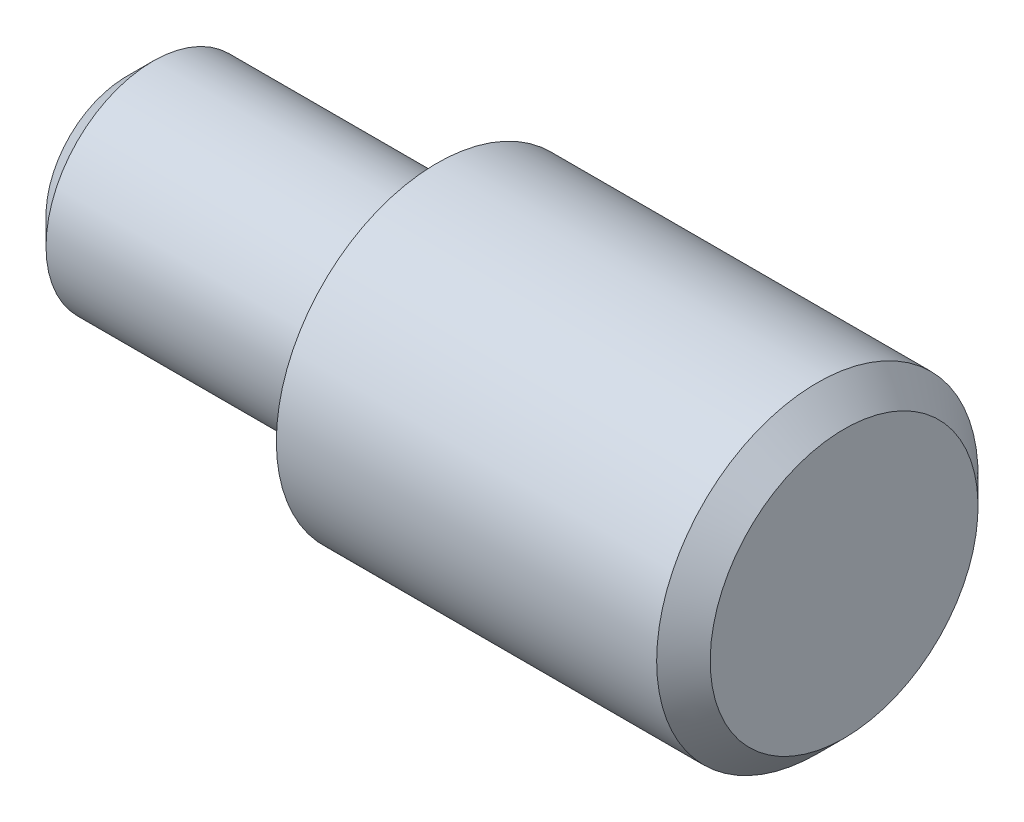
ISO-10303-21;
HEADER;
FILE_DESCRIPTION(('STEP AP214'),'2;1');
FILE_NAME('part.step','',(''),(''),'','','');
FILE_SCHEMA(('AUTOMOTIVE_DESIGN { 1 0 10303 214 1 1 1 1 }'));
ENDSEC;
DATA;
#1=APPLICATION_CONTEXT('core data for automotive mechanical design processes');
#2=APPLICATION_PROTOCOL_DEFINITION('international standard','automotive_design',2000,#1);
#3=PRODUCT_CONTEXT('',#1,'mechanical');
#4=PRODUCT('Part','Part','',(#3));
#5=PRODUCT_RELATED_PRODUCT_CATEGORY('part','',(#4));
#6=PRODUCT_DEFINITION_FORMATION('','',#4);
#7=PRODUCT_DEFINITION_CONTEXT('part definition',#1,'design');
#8=PRODUCT_DEFINITION('design','',#6,#7);
#9=PRODUCT_DEFINITION_SHAPE('','',#8);
#10=(LENGTH_UNIT() NAMED_UNIT(*) SI_UNIT(.MILLI.,.METRE.));
#11=(NAMED_UNIT(*) PLANE_ANGLE_UNIT() SI_UNIT($,.RADIAN.));
#12=(NAMED_UNIT(*) SI_UNIT($,.STERADIAN.) SOLID_ANGLE_UNIT());
#13=UNCERTAINTY_MEASURE_WITH_UNIT(LENGTH_MEASURE(1.E-05),#10,'distance_accuracy_value','');
#14=(GEOMETRIC_REPRESENTATION_CONTEXT(3) GLOBAL_UNCERTAINTY_ASSIGNED_CONTEXT((#13)) GLOBAL_UNIT_ASSIGNED_CONTEXT((#10,
#11,#12)) REPRESENTATION_CONTEXT('',''));
#15=CARTESIAN_POINT('',(0.,0.,0.));
#16=DIRECTION('',(0.,0.,1.));
#17=DIRECTION('',(1.,0.,0.));
#18=AXIS2_PLACEMENT_3D('',#15,#16,#17);
#19=CARTESIAN_POINT('',(0.,0.,0.));
#20=DIRECTION('',(1.,0.,0.));
#21=DIRECTION('',(0.,0.,-1.));
#22=AXIS2_PLACEMENT_3D('',#19,#20,#21);
#23=PLANE('',#22);
#24=CARTESIAN_POINT('',(5.6843418860808E-11,0.,0.));
#25=DIRECTION('',(1.,0.,0.));
#26=DIRECTION('',(0.,0.,-1.));
#27=AXIS2_PLACEMENT_3D('',#24,#25,#26);
#28=CIRCLE('',#27,1.49999999996453);
#29=CARTESIAN_POINT('',(5.6843418860808E-11,0.,-1.49999999996453));
#30=VERTEX_POINT('',#29);
#31=EDGE_CURVE('E17',#30,#30,#28,.T.);
#32=ORIENTED_EDGE('',*,*,#31,.F.);
#33=EDGE_LOOP('',(#32));
#34=FACE_BOUND('',#33,.T.);
#35=ADVANCED_FACE('F14',(#34),#23,.F.);
#36=CARTESIAN_POINT('',(0.50000000004502,0.,0.));
#37=DIRECTION('',(1.,0.,0.));
#38=DIRECTION('',(0.,0.,-1.));
#39=AXIS2_PLACEMENT_3D('',#36,#37,#38);
#40=CONICAL_SURFACE('',#39,2.00000000000955,0.785398163454292);
#41=ORIENTED_EDGE('',*,*,#31,.T.);
#42=EDGE_LOOP('',(#41));
#43=FACE_BOUND('',#42,.T.);
#44=CARTESIAN_POINT('',(0.500000000000004,0.,0.));
#45=DIRECTION('',(-1.,0.,0.));
#46=DIRECTION('',(0.,0.,1.));
#47=AXIS2_PLACEMENT_3D('',#44,#45,#46);
#48=CIRCLE('',#47,2.);
#49=CARTESIAN_POINT('',(0.500000000000004,0.,2.));
#50=VERTEX_POINT('',#49);
#51=EDGE_CURVE('E30',#50,#50,#48,.F.);
#52=ORIENTED_EDGE('',*,*,#51,.F.);
#53=EDGE_LOOP('',(#52));
#54=FACE_BOUND('',#53,.T.);
#55=ADVANCED_FACE('F42',(#43,#54),#40,.T.);
#56=CARTESIAN_POINT('',(13.4,0.,0.));
#57=DIRECTION('',(1.,0.,0.));
#58=DIRECTION('',(0.,0.,-1.));
#59=AXIS2_PLACEMENT_3D('',#56,#57,#58);
#60=PLANE('',#59);
#61=CARTESIAN_POINT('',(13.3999999999901,0.,0.));
#62=DIRECTION('',(-1.,0.,0.));
#63=DIRECTION('',(0.,-1.,0.));
#64=AXIS2_PLACEMENT_3D('',#61,#62,#63);
#65=CIRCLE('',#64,2.49999999999773);
#66=CARTESIAN_POINT('',(13.3999999999901,-2.49999999999773,0.));
#67=VERTEX_POINT('',#66);
#68=EDGE_CURVE('E32',#67,#67,#65,.T.);
#69=ORIENTED_EDGE('',*,*,#68,.F.);
#70=EDGE_LOOP('',(#69));
#71=FACE_BOUND('',#70,.T.);
#72=ADVANCED_FACE('F49',(#71),#60,.T.);
#73=CARTESIAN_POINT('',(5.8,0.,0.));
#74=DIRECTION('',(-1.,0.,0.));
#75=DIRECTION('',(0.,0.,1.));
#76=AXIS2_PLACEMENT_3D('',#73,#74,#75);
#77=CYLINDRICAL_SURFACE('',#76,2.);
#78=CARTESIAN_POINT('',(5.8,0.,0.));
#79=DIRECTION('',(-1.,0.,0.));
#80=DIRECTION('',(0.,0.,1.));
#81=AXIS2_PLACEMENT_3D('',#78,#79,#80);
#82=CIRCLE('',#81,2.);
#83=CARTESIAN_POINT('',(5.8,0.,2.));
#84=VERTEX_POINT('',#83);
#85=EDGE_CURVE('E26',#84,#84,#82,.T.);
#86=ORIENTED_EDGE('',*,*,#85,.T.);
#87=EDGE_LOOP('',(#86));
#88=FACE_BOUND('',#87,.T.);
#89=ORIENTED_EDGE('',*,*,#51,.T.);
#90=EDGE_LOOP('',(#89));
#91=FACE_BOUND('',#90,.T.);
#92=ADVANCED_FACE('F64',(#88,#91),#77,.T.);
#93=CARTESIAN_POINT('',(12.8999999999451,0.,0.));
#94=DIRECTION('',(-1.,0.,0.));
#95=DIRECTION('',(0.,-1.,0.));
#96=AXIS2_PLACEMENT_3D('',#93,#94,#95);
#97=CONICAL_SURFACE('',#96,3.00000000004275,0.785398163397448);
#98=CARTESIAN_POINT('',(12.9,0.,0.));
#99=DIRECTION('',(-1.,0.,0.));
#100=DIRECTION('',(0.,0.,1.));
#101=AXIS2_PLACEMENT_3D('',#98,#99,#100);
#102=CIRCLE('',#101,3.);
#103=CARTESIAN_POINT('',(12.9,0.,3.));
#104=VERTEX_POINT('',#103);
#105=EDGE_CURVE('E21',#104,#104,#102,.T.);
#106=ORIENTED_EDGE('',*,*,#105,.F.);
#107=EDGE_LOOP('',(#106));
#108=FACE_BOUND('',#107,.T.);
#109=ORIENTED_EDGE('',*,*,#68,.T.);
#110=EDGE_LOOP('',(#109));
#111=FACE_BOUND('',#110,.T.);
#112=ADVANCED_FACE('F57',(#108,#111),#97,.T.);
#113=CARTESIAN_POINT('',(5.8,0.,0.));
#114=DIRECTION('',(1.,0.,0.));
#115=DIRECTION('',(0.,0.,-1.));
#116=AXIS2_PLACEMENT_3D('',#113,#114,#115);
#117=PLANE('',#116);
#118=ORIENTED_EDGE('',*,*,#85,.F.);
#119=EDGE_LOOP('',(#118));
#120=FACE_BOUND('',#119,.T.);
#121=CARTESIAN_POINT('',(5.8,0.,0.));
#122=DIRECTION('',(-1.,0.,0.));
#123=DIRECTION('',(0.,0.,1.));
#124=AXIS2_PLACEMENT_3D('',#121,#122,#123);
#125=CIRCLE('',#124,3.);
#126=CARTESIAN_POINT('',(5.8,0.,3.));
#127=VERTEX_POINT('',#126);
#128=EDGE_CURVE('E8',#127,#127,#125,.F.);
#129=ORIENTED_EDGE('',*,*,#128,.F.);
#130=EDGE_LOOP('',(#129));
#131=FACE_BOUND('',#130,.T.);
#132=ADVANCED_FACE('F52',(#120,#131),#117,.F.);
#133=CARTESIAN_POINT('',(13.4,0.,0.));
#134=DIRECTION('',(-1.,0.,0.));
#135=DIRECTION('',(0.,0.,1.));
#136=AXIS2_PLACEMENT_3D('',#133,#134,#135);
#137=CYLINDRICAL_SURFACE('',#136,3.);
#138=ORIENTED_EDGE('',*,*,#128,.T.);
#139=EDGE_LOOP('',(#138));
#140=FACE_BOUND('',#139,.T.);
#141=ORIENTED_EDGE('',*,*,#105,.T.);
#142=EDGE_LOOP('',(#141));
#143=FACE_BOUND('',#142,.T.);
#144=ADVANCED_FACE('F50',(#140,#143),#137,.T.);
#145=CLOSED_SHELL('',(#35,#55,#72,#92,#112,#132,#144));
#146=MANIFOLD_SOLID_BREP('B1',#145);
#147=ADVANCED_BREP_SHAPE_REPRESENTATION('',(#18,#146),#14);
#148=SHAPE_DEFINITION_REPRESENTATION(#9,#147);
ENDSEC;
END-ISO-10303-21;
